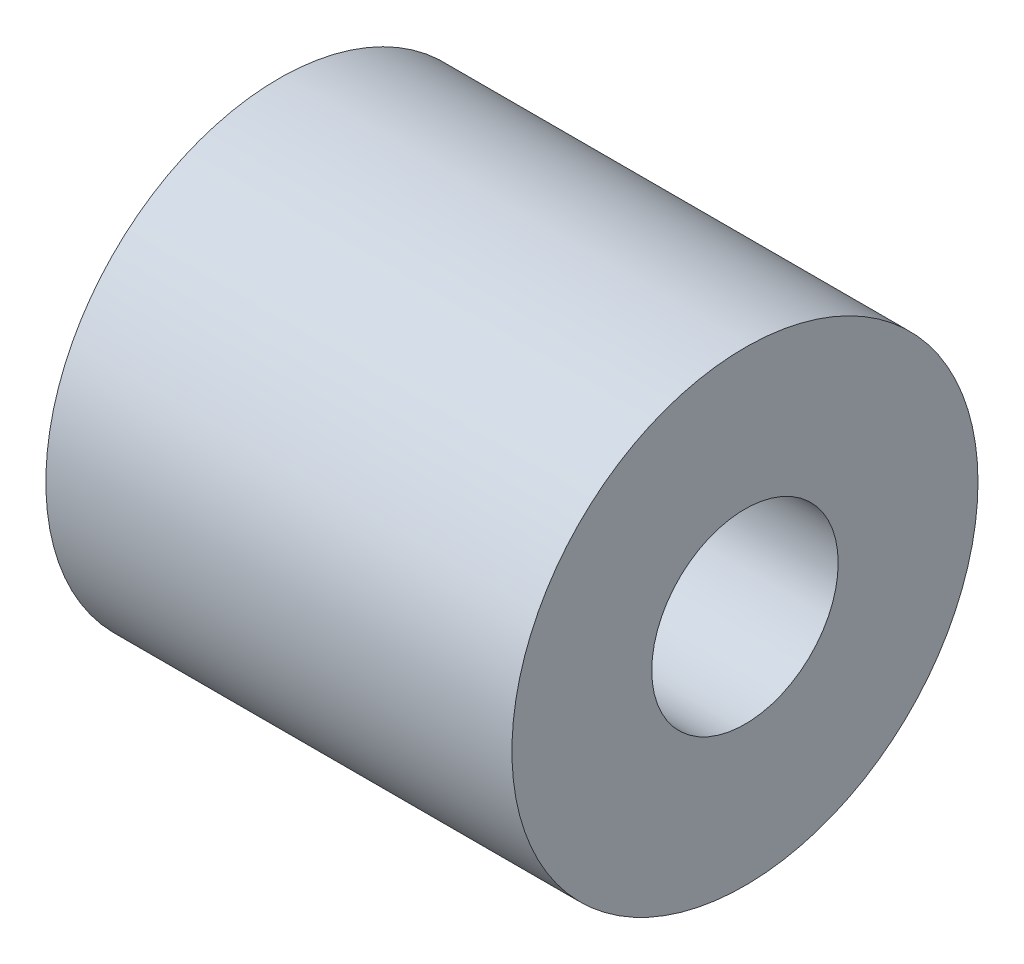
ISO-10303-21;
HEADER;
FILE_DESCRIPTION(('STEP AP214'),'2;1');
FILE_NAME('part.step','',(''),(''),'','','');
FILE_SCHEMA(('AUTOMOTIVE_DESIGN { 1 0 10303 214 1 1 1 1 }'));
ENDSEC;
DATA;
#1=APPLICATION_CONTEXT('core data for automotive mechanical design processes');
#2=APPLICATION_PROTOCOL_DEFINITION('international standard','automotive_design',2000,#1);
#3=PRODUCT_CONTEXT('',#1,'mechanical');
#4=PRODUCT('Part','Part','',(#3));
#5=PRODUCT_RELATED_PRODUCT_CATEGORY('part','',(#4));
#6=PRODUCT_DEFINITION_FORMATION('','',#4);
#7=PRODUCT_DEFINITION_CONTEXT('part definition',#1,'design');
#8=PRODUCT_DEFINITION('design','',#6,#7);
#9=PRODUCT_DEFINITION_SHAPE('','',#8);
#10=(LENGTH_UNIT() NAMED_UNIT(*) SI_UNIT(.MILLI.,.METRE.));
#11=(NAMED_UNIT(*) PLANE_ANGLE_UNIT() SI_UNIT($,.RADIAN.));
#12=(NAMED_UNIT(*) SI_UNIT($,.STERADIAN.) SOLID_ANGLE_UNIT());
#13=UNCERTAINTY_MEASURE_WITH_UNIT(LENGTH_MEASURE(1.E-05),#10,'distance_accuracy_value','');
#14=(GEOMETRIC_REPRESENTATION_CONTEXT(3) GLOBAL_UNCERTAINTY_ASSIGNED_CONTEXT((#13)) GLOBAL_UNIT_ASSIGNED_CONTEXT((#10,
#11,#12)) REPRESENTATION_CONTEXT('',''));
#15=CARTESIAN_POINT('',(0.,0.,0.));
#16=DIRECTION('',(0.,0.,1.));
#17=DIRECTION('',(1.,0.,0.));
#18=AXIS2_PLACEMENT_3D('',#15,#16,#17);
#19=CARTESIAN_POINT('',(10.,0.,0.));
#20=DIRECTION('',(1.,0.,0.));
#21=DIRECTION('',(0.,0.,-1.));
#22=AXIS2_PLACEMENT_3D('',#19,#20,#21);
#23=PLANE('',#22);
#24=CARTESIAN_POINT('',(10.,0.,0.));
#25=DIRECTION('',(1.,0.,0.));
#26=DIRECTION('',(0.,0.,-1.));
#27=AXIS2_PLACEMENT_3D('',#24,#25,#26);
#28=CIRCLE('',#27,5.);
#29=CARTESIAN_POINT('',(10.,0.,-5.));
#30=VERTEX_POINT('',#29);
#31=EDGE_CURVE('E10',#30,#30,#28,.T.);
#32=ORIENTED_EDGE('',*,*,#31,.T.);
#33=EDGE_LOOP('',(#32));
#34=FACE_BOUND('',#33,.T.);
#35=CARTESIAN_POINT('',(10.,0.,0.));
#36=DIRECTION('',(1.,0.,0.));
#37=DIRECTION('',(0.,0.,-1.));
#38=AXIS2_PLACEMENT_3D('',#35,#36,#37);
#39=CIRCLE('',#38,2.);
#40=CARTESIAN_POINT('',(10.,0.,-2.));
#41=VERTEX_POINT('',#40);
#42=EDGE_CURVE('E50',#41,#41,#39,.T.);
#43=ORIENTED_EDGE('',*,*,#42,.F.);
#44=EDGE_LOOP('',(#43));
#45=FACE_BOUND('',#44,.T.);
#46=ADVANCED_FACE('F37',(#34,#45),#23,.T.);
#47=CARTESIAN_POINT('',(0.,0.,0.));
#48=DIRECTION('',(1.,0.,0.));
#49=DIRECTION('',(0.,0.,-1.));
#50=AXIS2_PLACEMENT_3D('',#47,#48,#49);
#51=PLANE('',#50);
#52=CARTESIAN_POINT('',(0.,0.,0.));
#53=DIRECTION('',(1.,0.,0.));
#54=DIRECTION('',(0.,0.,-1.));
#55=AXIS2_PLACEMENT_3D('',#52,#53,#54);
#56=CIRCLE('',#55,5.);
#57=CARTESIAN_POINT('',(0.,0.,-5.));
#58=VERTEX_POINT('',#57);
#59=EDGE_CURVE('E41',#58,#58,#56,.T.);
#60=ORIENTED_EDGE('',*,*,#59,.F.);
#61=EDGE_LOOP('',(#60));
#62=FACE_BOUND('',#61,.T.);
#63=CARTESIAN_POINT('',(0.,0.,0.));
#64=DIRECTION('',(1.,0.,0.));
#65=DIRECTION('',(0.,0.,-1.));
#66=AXIS2_PLACEMENT_3D('',#63,#64,#65);
#67=CIRCLE('',#66,2.);
#68=CARTESIAN_POINT('',(0.,0.,-2.));
#69=VERTEX_POINT('',#68);
#70=EDGE_CURVE('E52',#69,#69,#67,.T.);
#71=ORIENTED_EDGE('',*,*,#70,.T.);
#72=EDGE_LOOP('',(#71));
#73=FACE_BOUND('',#72,.T.);
#74=ADVANCED_FACE('F64',(#62,#73),#51,.F.);
#75=CARTESIAN_POINT('',(10.,0.,0.));
#76=DIRECTION('',(-1.,0.,0.));
#77=DIRECTION('',(0.,0.,1.));
#78=AXIS2_PLACEMENT_3D('',#75,#76,#77);
#79=CYLINDRICAL_SURFACE('',#78,5.);
#80=ORIENTED_EDGE('',*,*,#31,.F.);
#81=EDGE_LOOP('',(#80));
#82=FACE_BOUND('',#81,.T.);
#83=ORIENTED_EDGE('',*,*,#59,.T.);
#84=EDGE_LOOP('',(#83));
#85=FACE_BOUND('',#84,.T.);
#86=ADVANCED_FACE('F39',(#82,#85),#79,.T.);
#87=CARTESIAN_POINT('',(10.,0.,0.));
#88=DIRECTION('',(-1.,0.,0.));
#89=DIRECTION('',(0.,0.,1.));
#90=AXIS2_PLACEMENT_3D('',#87,#88,#89);
#91=CYLINDRICAL_SURFACE('',#90,2.);
#92=ORIENTED_EDGE('',*,*,#42,.T.);
#93=EDGE_LOOP('',(#92));
#94=FACE_BOUND('',#93,.T.);
#95=ORIENTED_EDGE('',*,*,#70,.F.);
#96=EDGE_LOOP('',(#95));
#97=FACE_BOUND('',#96,.T.);
#98=ADVANCED_FACE('F60',(#94,#97),#91,.F.);
#99=CLOSED_SHELL('',(#46,#74,#86,#98));
#100=MANIFOLD_SOLID_BREP('B2',#99);
#101=ADVANCED_BREP_SHAPE_REPRESENTATION('',(#18,#100),#14);
#102=SHAPE_DEFINITION_REPRESENTATION(#9,#101);
ENDSEC;
END-ISO-10303-21;
